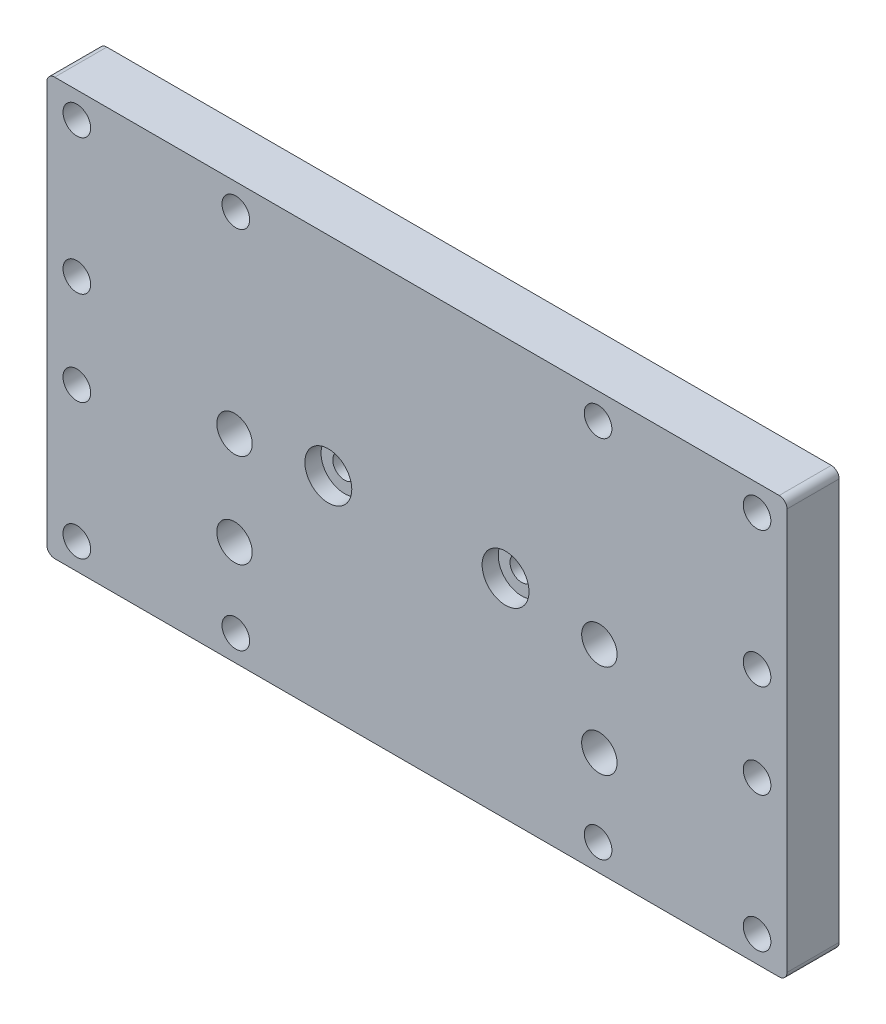
ISO-10303-21;
HEADER;
FILE_DESCRIPTION(('STEP AP214'),'2;1');
FILE_NAME('part.step','',(''),(''),'','','');
FILE_SCHEMA(('AUTOMOTIVE_DESIGN { 1 0 10303 214 1 1 1 1 }'));
ENDSEC;
DATA;
#1=APPLICATION_CONTEXT('core data for automotive mechanical design processes');
#2=APPLICATION_PROTOCOL_DEFINITION('international standard','automotive_design',2000,#1);
#3=PRODUCT_CONTEXT('',#1,'mechanical');
#4=PRODUCT('Part','Part','',(#3));
#5=PRODUCT_RELATED_PRODUCT_CATEGORY('part','',(#4));
#6=PRODUCT_DEFINITION_FORMATION('','',#4);
#7=PRODUCT_DEFINITION_CONTEXT('part definition',#1,'design');
#8=PRODUCT_DEFINITION('design','',#6,#7);
#9=PRODUCT_DEFINITION_SHAPE('','',#8);
#10=(LENGTH_UNIT() NAMED_UNIT(*) SI_UNIT(.MILLI.,.METRE.));
#11=(NAMED_UNIT(*) PLANE_ANGLE_UNIT() SI_UNIT($,.RADIAN.));
#12=(NAMED_UNIT(*) SI_UNIT($,.STERADIAN.) SOLID_ANGLE_UNIT());
#13=UNCERTAINTY_MEASURE_WITH_UNIT(LENGTH_MEASURE(1.E-05),#10,'distance_accuracy_value','');
#14=(GEOMETRIC_REPRESENTATION_CONTEXT(3) GLOBAL_UNCERTAINTY_ASSIGNED_CONTEXT((#13)) GLOBAL_UNIT_ASSIGNED_CONTEXT((#10,
#11,#12)) REPRESENTATION_CONTEXT('',''));
#15=CARTESIAN_POINT('',(0.,0.,0.));
#16=DIRECTION('',(0.,0.,1.));
#17=DIRECTION('',(1.,0.,0.));
#18=AXIS2_PLACEMENT_3D('',#15,#16,#17);
#19=CARTESIAN_POINT('',(71.,-40.,5.));
#20=DIRECTION('',(-1.,0.,0.));
#21=DIRECTION('',(0.,0.,1.));
#22=AXIS2_PLACEMENT_3D('',#19,#20,#21);
#23=PLANE('',#22);
#24=DIRECTION('',(0.,1.,0.));
#25=VECTOR('',#24,1.);
#26=CARTESIAN_POINT('',(71.,-40.,5.));
#27=LINE('',#26,#25);
#28=CARTESIAN_POINT('',(71.,-38.5,5.));
#29=VERTEX_POINT('',#28);
#30=CARTESIAN_POINT('',(71.,38.5,5.));
#31=VERTEX_POINT('',#30);
#32=EDGE_CURVE('E126',#29,#31,#27,.T.);
#33=ORIENTED_EDGE('',*,*,#32,.F.);
#34=DIRECTION('',(0.,0.,-1.));
#35=VECTOR('',#34,1.);
#36=CARTESIAN_POINT('',(71.,-38.5,5.));
#37=LINE('',#36,#35);
#38=CARTESIAN_POINT('',(71.,-38.5,-5.));
#39=VERTEX_POINT('',#38);
#40=EDGE_CURVE('E152',#29,#39,#37,.T.);
#41=ORIENTED_EDGE('',*,*,#40,.T.);
#42=DIRECTION('',(0.,1.,0.));
#43=VECTOR('',#42,1.);
#44=CARTESIAN_POINT('',(71.,-40.,-5.));
#45=LINE('',#44,#43);
#46=CARTESIAN_POINT('',(71.,38.5,-5.));
#47=VERTEX_POINT('',#46);
#48=EDGE_CURVE('E158',#39,#47,#45,.T.);
#49=ORIENTED_EDGE('',*,*,#48,.T.);
#50=DIRECTION('',(0.,0.,-1.));
#51=VECTOR('',#50,1.);
#52=CARTESIAN_POINT('',(71.,38.5,5.));
#53=LINE('',#52,#51);
#54=EDGE_CURVE('E150',#47,#31,#53,.F.);
#55=ORIENTED_EDGE('',*,*,#54,.T.);
#56=EDGE_LOOP('',(#33,#41,#49,#55));
#57=FACE_BOUND('',#56,.T.);
#58=ADVANCED_FACE('F34',(#57),#23,.F.);
#59=CARTESIAN_POINT('',(-71.,40.,5.));
#60=DIRECTION('',(0.,-1.,0.));
#61=DIRECTION('',(0.,0.,-1.));
#62=AXIS2_PLACEMENT_3D('',#59,#60,#61);
#63=PLANE('',#62);
#64=DIRECTION('',(-1.,0.,0.));
#65=VECTOR('',#64,1.);
#66=CARTESIAN_POINT('',(-71.,40.,5.));
#67=LINE('',#66,#65);
#68=CARTESIAN_POINT('',(69.5,40.,5.));
#69=VERTEX_POINT('',#68);
#70=CARTESIAN_POINT('',(-69.5,40.,5.));
#71=VERTEX_POINT('',#70);
#72=EDGE_CURVE('E129',#69,#71,#67,.T.);
#73=ORIENTED_EDGE('',*,*,#72,.F.);
#74=DIRECTION('',(0.,0.,-1.));
#75=VECTOR('',#74,1.);
#76=CARTESIAN_POINT('',(69.5,40.,5.));
#77=LINE('',#76,#75);
#78=CARTESIAN_POINT('',(69.5,40.,-5.));
#79=VERTEX_POINT('',#78);
#80=EDGE_CURVE('E11',#69,#79,#77,.T.);
#81=ORIENTED_EDGE('',*,*,#80,.T.);
#82=DIRECTION('',(-1.,0.,0.));
#83=VECTOR('',#82,1.);
#84=CARTESIAN_POINT('',(-71.,40.,-5.));
#85=LINE('',#84,#83);
#86=CARTESIAN_POINT('',(-69.5,40.,-5.));
#87=VERTEX_POINT('',#86);
#88=EDGE_CURVE('E131',#79,#87,#85,.T.);
#89=ORIENTED_EDGE('',*,*,#88,.T.);
#90=DIRECTION('',(0.,0.,-1.));
#91=VECTOR('',#90,1.);
#92=CARTESIAN_POINT('',(-69.5,40.,5.));
#93=LINE('',#92,#91);
#94=EDGE_CURVE('E42',#87,#71,#93,.F.);
#95=ORIENTED_EDGE('',*,*,#94,.T.);
#96=EDGE_LOOP('',(#73,#81,#89,#95));
#97=FACE_BOUND('',#96,.T.);
#98=ADVANCED_FACE('F336',(#97),#63,.F.);
#99=CARTESIAN_POINT('',(-71.,-40.,5.));
#100=DIRECTION('',(1.,0.,0.));
#101=DIRECTION('',(0.,0.,-1.));
#102=AXIS2_PLACEMENT_3D('',#99,#100,#101);
#103=PLANE('',#102);
#104=DIRECTION('',(0.,-1.,0.));
#105=VECTOR('',#104,1.);
#106=CARTESIAN_POINT('',(-71.,-40.,-5.));
#107=LINE('',#106,#105);
#108=CARTESIAN_POINT('',(-71.,38.5,-5.));
#109=VERTEX_POINT('',#108);
#110=CARTESIAN_POINT('',(-71.,-38.5,-5.));
#111=VERTEX_POINT('',#110);
#112=EDGE_CURVE('E127',#109,#111,#107,.T.);
#113=ORIENTED_EDGE('',*,*,#112,.T.);
#114=DIRECTION('',(0.,0.,-1.));
#115=VECTOR('',#114,1.);
#116=CARTESIAN_POINT('',(-71.,-38.5,5.));
#117=LINE('',#116,#115);
#118=CARTESIAN_POINT('',(-71.,-38.5,5.));
#119=VERTEX_POINT('',#118);
#120=EDGE_CURVE('E105',#111,#119,#117,.F.);
#121=ORIENTED_EDGE('',*,*,#120,.T.);
#122=DIRECTION('',(0.,-1.,0.));
#123=VECTOR('',#122,1.);
#124=CARTESIAN_POINT('',(-71.,-40.,5.));
#125=LINE('',#124,#123);
#126=CARTESIAN_POINT('',(-71.,38.5,5.));
#127=VERTEX_POINT('',#126);
#128=EDGE_CURVE('E170',#127,#119,#125,.T.);
#129=ORIENTED_EDGE('',*,*,#128,.F.);
#130=DIRECTION('',(0.,0.,-1.));
#131=VECTOR('',#130,1.);
#132=CARTESIAN_POINT('',(-71.,38.5,5.));
#133=LINE('',#132,#131);
#134=EDGE_CURVE('E110',#127,#109,#133,.T.);
#135=ORIENTED_EDGE('',*,*,#134,.T.);
#136=EDGE_LOOP('',(#113,#121,#129,#135));
#137=FACE_BOUND('',#136,.T.);
#138=ADVANCED_FACE('F334',(#137),#103,.F.);
#139=CARTESIAN_POINT('',(-71.,-40.,5.));
#140=DIRECTION('',(0.,1.,0.));
#141=DIRECTION('',(0.,0.,1.));
#142=AXIS2_PLACEMENT_3D('',#139,#140,#141);
#143=PLANE('',#142);
#144=DIRECTION('',(1.,0.,0.));
#145=VECTOR('',#144,1.);
#146=CARTESIAN_POINT('',(-71.,-40.,5.));
#147=LINE('',#146,#145);
#148=CARTESIAN_POINT('',(-69.5,-40.,5.));
#149=VERTEX_POINT('',#148);
#150=CARTESIAN_POINT('',(69.5,-40.,5.));
#151=VERTEX_POINT('',#150);
#152=EDGE_CURVE('E120',#149,#151,#147,.T.);
#153=ORIENTED_EDGE('',*,*,#152,.F.);
#154=DIRECTION('',(0.,0.,-1.));
#155=VECTOR('',#154,1.);
#156=CARTESIAN_POINT('',(-69.5,-40.,5.));
#157=LINE('',#156,#155);
#158=CARTESIAN_POINT('',(-69.5,-40.,-5.));
#159=VERTEX_POINT('',#158);
#160=EDGE_CURVE('E104',#149,#159,#157,.T.);
#161=ORIENTED_EDGE('',*,*,#160,.T.);
#162=DIRECTION('',(1.,0.,0.));
#163=VECTOR('',#162,1.);
#164=CARTESIAN_POINT('',(-71.,-40.,-5.));
#165=LINE('',#164,#163);
#166=CARTESIAN_POINT('',(69.5,-40.,-5.));
#167=VERTEX_POINT('',#166);
#168=EDGE_CURVE('E117',#159,#167,#165,.T.);
#169=ORIENTED_EDGE('',*,*,#168,.T.);
#170=DIRECTION('',(0.,0.,-1.));
#171=VECTOR('',#170,1.);
#172=CARTESIAN_POINT('',(69.5,-40.,5.));
#173=LINE('',#172,#171);
#174=EDGE_CURVE('E122',#167,#151,#173,.F.);
#175=ORIENTED_EDGE('',*,*,#174,.T.);
#176=EDGE_LOOP('',(#153,#161,#169,#175));
#177=FACE_BOUND('',#176,.T.);
#178=ADVANCED_FACE('F116',(#177),#143,.F.);
#179=CARTESIAN_POINT('',(0.,0.,5.));
#180=DIRECTION('',(0.,0.,-1.));
#181=DIRECTION('',(-1.,0.,0.));
#182=AXIS2_PLACEMENT_3D('',#179,#180,#181);
#183=PLANE('',#182);
#184=CARTESIAN_POINT('',(-35.,-2.00000000000001,5.));
#185=DIRECTION('',(0.,0.,1.));
#186=DIRECTION('',(1.,0.,0.));
#187=AXIS2_PLACEMENT_3D('',#184,#185,#186);
#188=CIRCLE('',#187,3.39999999999999);
#189=CARTESIAN_POINT('',(-31.6,-2.00000000000001,5.));
#190=VERTEX_POINT('',#189);
#191=EDGE_CURVE('E287',#190,#190,#188,.T.);
#192=ORIENTED_EDGE('',*,*,#191,.F.);
#193=EDGE_LOOP('',(#192));
#194=FACE_BOUND('',#193,.T.);
#195=CARTESIAN_POINT('',(35.,-2.00000000000001,5.));
#196=DIRECTION('',(0.,0.,1.));
#197=DIRECTION('',(1.,0.,0.));
#198=AXIS2_PLACEMENT_3D('',#195,#196,#197);
#199=CIRCLE('',#198,3.39999999999999);
#200=CARTESIAN_POINT('',(38.4,-2.00000000000001,5.));
#201=VERTEX_POINT('',#200);
#202=EDGE_CURVE('E281',#201,#201,#199,.T.);
#203=ORIENTED_EDGE('',*,*,#202,.F.);
#204=EDGE_LOOP('',(#203));
#205=FACE_BOUND('',#204,.T.);
#206=CARTESIAN_POINT('',(35.,-20.,5.));
#207=DIRECTION('',(0.,0.,1.));
#208=DIRECTION('',(1.,0.,0.));
#209=AXIS2_PLACEMENT_3D('',#206,#207,#208);
#210=CIRCLE('',#209,3.39999999999999);
#211=CARTESIAN_POINT('',(38.4,-20.,5.));
#212=VERTEX_POINT('',#211);
#213=EDGE_CURVE('E275',#212,#212,#210,.T.);
#214=ORIENTED_EDGE('',*,*,#213,.F.);
#215=EDGE_LOOP('',(#214));
#216=FACE_BOUND('',#215,.T.);
#217=CARTESIAN_POINT('',(-35.,-20.,5.));
#218=DIRECTION('',(0.,0.,1.));
#219=DIRECTION('',(1.,0.,0.));
#220=AXIS2_PLACEMENT_3D('',#217,#218,#219);
#221=CIRCLE('',#220,3.39999999999999);
#222=CARTESIAN_POINT('',(-31.6,-20.,5.));
#223=VERTEX_POINT('',#222);
#224=EDGE_CURVE('E269',#223,#223,#221,.T.);
#225=ORIENTED_EDGE('',*,*,#224,.F.);
#226=EDGE_LOOP('',(#225));
#227=FACE_BOUND('',#226,.T.);
#228=CARTESIAN_POINT('',(-17.,0.,5.));
#229=DIRECTION('',(0.,0.,1.));
#230=DIRECTION('',(1.,0.,0.));
#231=AXIS2_PLACEMENT_3D('',#228,#229,#230);
#232=CIRCLE('',#231,4.5);
#233=CARTESIAN_POINT('',(-12.5,0.,5.));
#234=VERTEX_POINT('',#233);
#235=EDGE_CURVE('E263',#234,#234,#232,.T.);
#236=ORIENTED_EDGE('',*,*,#235,.F.);
#237=EDGE_LOOP('',(#236));
#238=FACE_BOUND('',#237,.T.);
#239=CARTESIAN_POINT('',(17.,0.,5.));
#240=DIRECTION('',(0.,0.,1.));
#241=DIRECTION('',(1.,0.,0.));
#242=AXIS2_PLACEMENT_3D('',#239,#240,#241);
#243=CIRCLE('',#242,4.5);
#244=CARTESIAN_POINT('',(21.5,0.,5.));
#245=VERTEX_POINT('',#244);
#246=EDGE_CURVE('E251',#245,#245,#243,.T.);
#247=ORIENTED_EDGE('',*,*,#246,.F.);
#248=EDGE_LOOP('',(#247));
#249=FACE_BOUND('',#248,.T.);
#250=CARTESIAN_POINT('',(-65.25,-35.,5.));
#251=DIRECTION('',(0.,0.,1.));
#252=DIRECTION('',(1.,0.,0.));
#253=AXIS2_PLACEMENT_3D('',#250,#251,#252);
#254=CIRCLE('',#253,2.64999999999999);
#255=CARTESIAN_POINT('',(-62.6,-35.,5.));
#256=VERTEX_POINT('',#255);
#257=EDGE_CURVE('E239',#256,#256,#254,.T.);
#258=ORIENTED_EDGE('',*,*,#257,.F.);
#259=EDGE_LOOP('',(#258));
#260=FACE_BOUND('',#259,.T.);
#261=CARTESIAN_POINT('',(-34.75,-35.,5.));
#262=DIRECTION('',(0.,0.,1.));
#263=DIRECTION('',(1.,0.,0.));
#264=AXIS2_PLACEMENT_3D('',#261,#262,#263);
#265=CIRCLE('',#264,2.64999999999999);
#266=CARTESIAN_POINT('',(-32.1,-35.,5.));
#267=VERTEX_POINT('',#266);
#268=EDGE_CURVE('E233',#267,#267,#265,.T.);
#269=ORIENTED_EDGE('',*,*,#268,.F.);
#270=EDGE_LOOP('',(#269));
#271=FACE_BOUND('',#270,.T.);
#272=CARTESIAN_POINT('',(-65.25,-9.,5.));
#273=DIRECTION('',(0.,0.,1.));
#274=DIRECTION('',(1.,0.,0.));
#275=AXIS2_PLACEMENT_3D('',#272,#273,#274);
#276=CIRCLE('',#275,2.64999999999999);
#277=CARTESIAN_POINT('',(-62.6,-9.,5.));
#278=VERTEX_POINT('',#277);
#279=EDGE_CURVE('E227',#278,#278,#276,.T.);
#280=ORIENTED_EDGE('',*,*,#279,.F.);
#281=EDGE_LOOP('',(#280));
#282=FACE_BOUND('',#281,.T.);
#283=CARTESIAN_POINT('',(65.25,-35.,5.));
#284=DIRECTION('',(0.,0.,1.));
#285=DIRECTION('',(1.,0.,0.));
#286=AXIS2_PLACEMENT_3D('',#283,#284,#285);
#287=CIRCLE('',#286,2.64999999999999);
#288=CARTESIAN_POINT('',(67.9,-35.,5.));
#289=VERTEX_POINT('',#288);
#290=EDGE_CURVE('E221',#289,#289,#287,.T.);
#291=ORIENTED_EDGE('',*,*,#290,.F.);
#292=EDGE_LOOP('',(#291));
#293=FACE_BOUND('',#292,.T.);
#294=CARTESIAN_POINT('',(34.75,-35.,5.));
#295=DIRECTION('',(0.,0.,1.));
#296=DIRECTION('',(1.,0.,0.));
#297=AXIS2_PLACEMENT_3D('',#294,#295,#296);
#298=CIRCLE('',#297,2.64999999999999);
#299=CARTESIAN_POINT('',(37.4,-35.,5.));
#300=VERTEX_POINT('',#299);
#301=EDGE_CURVE('E215',#300,#300,#298,.T.);
#302=ORIENTED_EDGE('',*,*,#301,.F.);
#303=EDGE_LOOP('',(#302));
#304=FACE_BOUND('',#303,.T.);
#305=CARTESIAN_POINT('',(65.25,-9.,5.));
#306=DIRECTION('',(0.,0.,1.));
#307=DIRECTION('',(1.,0.,0.));
#308=AXIS2_PLACEMENT_3D('',#305,#306,#307);
#309=CIRCLE('',#308,2.64999999999999);
#310=CARTESIAN_POINT('',(67.9,-9.,5.));
#311=VERTEX_POINT('',#310);
#312=EDGE_CURVE('E209',#311,#311,#309,.T.);
#313=ORIENTED_EDGE('',*,*,#312,.F.);
#314=EDGE_LOOP('',(#313));
#315=FACE_BOUND('',#314,.T.);
#316=CARTESIAN_POINT('',(65.25,35.,5.));
#317=DIRECTION('',(0.,0.,1.));
#318=DIRECTION('',(1.,0.,0.));
#319=AXIS2_PLACEMENT_3D('',#316,#317,#318);
#320=CIRCLE('',#319,2.64999999999999);
#321=CARTESIAN_POINT('',(67.9,35.,5.));
#322=VERTEX_POINT('',#321);
#323=EDGE_CURVE('E203',#322,#322,#320,.T.);
#324=ORIENTED_EDGE('',*,*,#323,.F.);
#325=EDGE_LOOP('',(#324));
#326=FACE_BOUND('',#325,.T.);
#327=CARTESIAN_POINT('',(34.75,35.,5.));
#328=DIRECTION('',(0.,0.,1.));
#329=DIRECTION('',(1.,0.,0.));
#330=AXIS2_PLACEMENT_3D('',#327,#328,#329);
#331=CIRCLE('',#330,2.64999999999999);
#332=CARTESIAN_POINT('',(37.4,35.,5.));
#333=VERTEX_POINT('',#332);
#334=EDGE_CURVE('E197',#333,#333,#331,.T.);
#335=ORIENTED_EDGE('',*,*,#334,.F.);
#336=EDGE_LOOP('',(#335));
#337=FACE_BOUND('',#336,.T.);
#338=CARTESIAN_POINT('',(65.25,9.,5.));
#339=DIRECTION('',(0.,0.,1.));
#340=DIRECTION('',(1.,0.,0.));
#341=AXIS2_PLACEMENT_3D('',#338,#339,#340);
#342=CIRCLE('',#341,2.64999999999999);
#343=CARTESIAN_POINT('',(67.9,9.,5.));
#344=VERTEX_POINT('',#343);
#345=EDGE_CURVE('E191',#344,#344,#342,.T.);
#346=ORIENTED_EDGE('',*,*,#345,.F.);
#347=EDGE_LOOP('',(#346));
#348=FACE_BOUND('',#347,.T.);
#349=CARTESIAN_POINT('',(-65.25,35.,5.));
#350=DIRECTION('',(0.,0.,1.));
#351=DIRECTION('',(1.,0.,0.));
#352=AXIS2_PLACEMENT_3D('',#349,#350,#351);
#353=CIRCLE('',#352,2.64999999999999);
#354=CARTESIAN_POINT('',(-62.6,35.,5.));
#355=VERTEX_POINT('',#354);
#356=EDGE_CURVE('E185',#355,#355,#353,.T.);
#357=ORIENTED_EDGE('',*,*,#356,.F.);
#358=EDGE_LOOP('',(#357));
#359=FACE_BOUND('',#358,.T.);
#360=CARTESIAN_POINT('',(-34.75,35.,5.));
#361=DIRECTION('',(0.,0.,1.));
#362=DIRECTION('',(1.,0.,0.));
#363=AXIS2_PLACEMENT_3D('',#360,#361,#362);
#364=CIRCLE('',#363,2.64999999999999);
#365=CARTESIAN_POINT('',(-32.1,35.,5.));
#366=VERTEX_POINT('',#365);
#367=EDGE_CURVE('E179',#366,#366,#364,.T.);
#368=ORIENTED_EDGE('',*,*,#367,.F.);
#369=EDGE_LOOP('',(#368));
#370=FACE_BOUND('',#369,.T.);
#371=CARTESIAN_POINT('',(-65.25,9.,5.));
#372=DIRECTION('',(0.,0.,1.));
#373=DIRECTION('',(1.,0.,0.));
#374=AXIS2_PLACEMENT_3D('',#371,#372,#373);
#375=CIRCLE('',#374,2.64999999999999);
#376=CARTESIAN_POINT('',(-62.6,9.,5.));
#377=VERTEX_POINT('',#376);
#378=EDGE_CURVE('E166',#377,#377,#375,.T.);
#379=ORIENTED_EDGE('',*,*,#378,.F.);
#380=EDGE_LOOP('',(#379));
#381=FACE_BOUND('',#380,.T.);
#382=ORIENTED_EDGE('',*,*,#128,.T.);
#383=CARTESIAN_POINT('',(-69.5,-38.5,5.));
#384=DIRECTION('',(0.,0.,-1.));
#385=DIRECTION('',(-1.,0.,0.));
#386=AXIS2_PLACEMENT_3D('',#383,#384,#385);
#387=CIRCLE('',#386,1.5);
#388=EDGE_CURVE('E148',#119,#149,#387,.F.);
#389=ORIENTED_EDGE('',*,*,#388,.T.);
#390=ORIENTED_EDGE('',*,*,#152,.T.);
#391=CARTESIAN_POINT('',(69.5,-38.5,5.));
#392=DIRECTION('',(0.,0.,-1.));
#393=DIRECTION('',(-1.,0.,0.));
#394=AXIS2_PLACEMENT_3D('',#391,#392,#393);
#395=CIRCLE('',#394,1.5);
#396=EDGE_CURVE('E146',#151,#29,#395,.F.);
#397=ORIENTED_EDGE('',*,*,#396,.T.);
#398=ORIENTED_EDGE('',*,*,#32,.T.);
#399=CARTESIAN_POINT('',(69.5,38.5,5.));
#400=DIRECTION('',(0.,0.,-1.));
#401=DIRECTION('',(-1.,0.,0.));
#402=AXIS2_PLACEMENT_3D('',#399,#400,#401);
#403=CIRCLE('',#402,1.5);
#404=EDGE_CURVE('E55',#31,#69,#403,.F.);
#405=ORIENTED_EDGE('',*,*,#404,.T.);
#406=ORIENTED_EDGE('',*,*,#72,.T.);
#407=CARTESIAN_POINT('',(-69.5,38.5,5.));
#408=DIRECTION('',(0.,0.,-1.));
#409=DIRECTION('',(-1.,0.,0.));
#410=AXIS2_PLACEMENT_3D('',#407,#408,#409);
#411=CIRCLE('',#410,1.5);
#412=EDGE_CURVE('E143',#71,#127,#411,.F.);
#413=ORIENTED_EDGE('',*,*,#412,.T.);
#414=EDGE_LOOP('',(#382,#389,#390,#397,#398,#405,#406,#413));
#415=FACE_BOUND('',#414,.T.);
#416=ADVANCED_FACE('F293',(#194,#205,#216,#227,#238,#249,#260,#271,#282,#293,#304,#315,#326,
#337,#348,#359,#370,#381,#415),#183,.F.);
#417=CARTESIAN_POINT('',(0.,0.,-5.));
#418=DIRECTION('',(0.,0.,-1.));
#419=DIRECTION('',(-1.,0.,0.));
#420=AXIS2_PLACEMENT_3D('',#417,#418,#419);
#421=PLANE('',#420);
#422=CARTESIAN_POINT('',(-35.,-2.00000000000001,-5.));
#423=DIRECTION('',(0.,0.,1.));
#424=DIRECTION('',(1.,0.,0.));
#425=AXIS2_PLACEMENT_3D('',#422,#423,#424);
#426=CIRCLE('',#425,3.39999999999999);
#427=CARTESIAN_POINT('',(-31.6,-2.00000000000001,-5.));
#428=VERTEX_POINT('',#427);
#429=EDGE_CURVE('E284',#428,#428,#426,.T.);
#430=ORIENTED_EDGE('',*,*,#429,.T.);
#431=EDGE_LOOP('',(#430));
#432=FACE_BOUND('',#431,.T.);
#433=CARTESIAN_POINT('',(35.,-2.00000000000001,-5.));
#434=DIRECTION('',(0.,0.,1.));
#435=DIRECTION('',(1.,0.,0.));
#436=AXIS2_PLACEMENT_3D('',#433,#434,#435);
#437=CIRCLE('',#436,3.39999999999999);
#438=CARTESIAN_POINT('',(38.4,-2.00000000000001,-5.));
#439=VERTEX_POINT('',#438);
#440=EDGE_CURVE('E278',#439,#439,#437,.T.);
#441=ORIENTED_EDGE('',*,*,#440,.T.);
#442=EDGE_LOOP('',(#441));
#443=FACE_BOUND('',#442,.T.);
#444=CARTESIAN_POINT('',(35.,-20.,-5.));
#445=DIRECTION('',(0.,0.,1.));
#446=DIRECTION('',(1.,0.,0.));
#447=AXIS2_PLACEMENT_3D('',#444,#445,#446);
#448=CIRCLE('',#447,3.39999999999999);
#449=CARTESIAN_POINT('',(38.4,-20.,-5.));
#450=VERTEX_POINT('',#449);
#451=EDGE_CURVE('E272',#450,#450,#448,.T.);
#452=ORIENTED_EDGE('',*,*,#451,.T.);
#453=EDGE_LOOP('',(#452));
#454=FACE_BOUND('',#453,.T.);
#455=CARTESIAN_POINT('',(-35.,-20.,-5.));
#456=DIRECTION('',(0.,0.,1.));
#457=DIRECTION('',(1.,0.,0.));
#458=AXIS2_PLACEMENT_3D('',#455,#456,#457);
#459=CIRCLE('',#458,3.39999999999999);
#460=CARTESIAN_POINT('',(-31.6,-20.,-5.));
#461=VERTEX_POINT('',#460);
#462=EDGE_CURVE('E266',#461,#461,#459,.T.);
#463=ORIENTED_EDGE('',*,*,#462,.T.);
#464=EDGE_LOOP('',(#463));
#465=FACE_BOUND('',#464,.T.);
#466=CARTESIAN_POINT('',(-17.,0.,-5.));
#467=DIRECTION('',(0.,0.,1.));
#468=DIRECTION('',(1.,0.,0.));
#469=AXIS2_PLACEMENT_3D('',#466,#467,#468);
#470=CIRCLE('',#469,2.25);
#471=CARTESIAN_POINT('',(-14.75,0.,-5.));
#472=VERTEX_POINT('',#471);
#473=EDGE_CURVE('E254',#472,#472,#470,.T.);
#474=ORIENTED_EDGE('',*,*,#473,.T.);
#475=EDGE_LOOP('',(#474));
#476=FACE_BOUND('',#475,.T.);
#477=CARTESIAN_POINT('',(17.,0.,-5.));
#478=DIRECTION('',(0.,0.,1.));
#479=DIRECTION('',(1.,0.,0.));
#480=AXIS2_PLACEMENT_3D('',#477,#478,#479);
#481=CIRCLE('',#480,2.25);
#482=CARTESIAN_POINT('',(19.25,0.,-5.));
#483=VERTEX_POINT('',#482);
#484=EDGE_CURVE('E242',#483,#483,#481,.T.);
#485=ORIENTED_EDGE('',*,*,#484,.T.);
#486=EDGE_LOOP('',(#485));
#487=FACE_BOUND('',#486,.T.);
#488=CARTESIAN_POINT('',(-65.25,-35.,-5.));
#489=DIRECTION('',(0.,0.,1.));
#490=DIRECTION('',(1.,0.,0.));
#491=AXIS2_PLACEMENT_3D('',#488,#489,#490);
#492=CIRCLE('',#491,2.64999999999999);
#493=CARTESIAN_POINT('',(-62.6,-35.,-5.));
#494=VERTEX_POINT('',#493);
#495=EDGE_CURVE('E236',#494,#494,#492,.T.);
#496=ORIENTED_EDGE('',*,*,#495,.T.);
#497=EDGE_LOOP('',(#496));
#498=FACE_BOUND('',#497,.T.);
#499=CARTESIAN_POINT('',(-34.75,-35.,-5.));
#500=DIRECTION('',(0.,0.,1.));
#501=DIRECTION('',(1.,0.,0.));
#502=AXIS2_PLACEMENT_3D('',#499,#500,#501);
#503=CIRCLE('',#502,2.64999999999999);
#504=CARTESIAN_POINT('',(-32.1,-35.,-5.));
#505=VERTEX_POINT('',#504);
#506=EDGE_CURVE('E230',#505,#505,#503,.T.);
#507=ORIENTED_EDGE('',*,*,#506,.T.);
#508=EDGE_LOOP('',(#507));
#509=FACE_BOUND('',#508,.T.);
#510=CARTESIAN_POINT('',(-65.25,-9.,-5.));
#511=DIRECTION('',(0.,0.,1.));
#512=DIRECTION('',(1.,0.,0.));
#513=AXIS2_PLACEMENT_3D('',#510,#511,#512);
#514=CIRCLE('',#513,2.64999999999999);
#515=CARTESIAN_POINT('',(-62.6,-9.,-5.));
#516=VERTEX_POINT('',#515);
#517=EDGE_CURVE('E224',#516,#516,#514,.T.);
#518=ORIENTED_EDGE('',*,*,#517,.T.);
#519=EDGE_LOOP('',(#518));
#520=FACE_BOUND('',#519,.T.);
#521=CARTESIAN_POINT('',(65.25,-35.,-5.));
#522=DIRECTION('',(0.,0.,1.));
#523=DIRECTION('',(1.,0.,0.));
#524=AXIS2_PLACEMENT_3D('',#521,#522,#523);
#525=CIRCLE('',#524,2.64999999999999);
#526=CARTESIAN_POINT('',(67.9,-35.,-5.));
#527=VERTEX_POINT('',#526);
#528=EDGE_CURVE('E218',#527,#527,#525,.T.);
#529=ORIENTED_EDGE('',*,*,#528,.T.);
#530=EDGE_LOOP('',(#529));
#531=FACE_BOUND('',#530,.T.);
#532=CARTESIAN_POINT('',(34.75,-35.,-5.));
#533=DIRECTION('',(0.,0.,1.));
#534=DIRECTION('',(1.,0.,0.));
#535=AXIS2_PLACEMENT_3D('',#532,#533,#534);
#536=CIRCLE('',#535,2.64999999999999);
#537=CARTESIAN_POINT('',(37.4,-35.,-5.));
#538=VERTEX_POINT('',#537);
#539=EDGE_CURVE('E212',#538,#538,#536,.T.);
#540=ORIENTED_EDGE('',*,*,#539,.T.);
#541=EDGE_LOOP('',(#540));
#542=FACE_BOUND('',#541,.T.);
#543=CARTESIAN_POINT('',(65.25,-9.,-5.));
#544=DIRECTION('',(0.,0.,1.));
#545=DIRECTION('',(1.,0.,0.));
#546=AXIS2_PLACEMENT_3D('',#543,#544,#545);
#547=CIRCLE('',#546,2.64999999999999);
#548=CARTESIAN_POINT('',(67.9,-9.,-5.));
#549=VERTEX_POINT('',#548);
#550=EDGE_CURVE('E206',#549,#549,#547,.T.);
#551=ORIENTED_EDGE('',*,*,#550,.T.);
#552=EDGE_LOOP('',(#551));
#553=FACE_BOUND('',#552,.T.);
#554=CARTESIAN_POINT('',(65.25,35.,-5.));
#555=DIRECTION('',(0.,0.,1.));
#556=DIRECTION('',(1.,0.,0.));
#557=AXIS2_PLACEMENT_3D('',#554,#555,#556);
#558=CIRCLE('',#557,2.64999999999999);
#559=CARTESIAN_POINT('',(67.9,35.,-5.));
#560=VERTEX_POINT('',#559);
#561=EDGE_CURVE('E200',#560,#560,#558,.T.);
#562=ORIENTED_EDGE('',*,*,#561,.T.);
#563=EDGE_LOOP('',(#562));
#564=FACE_BOUND('',#563,.T.);
#565=CARTESIAN_POINT('',(34.75,35.,-5.));
#566=DIRECTION('',(0.,0.,1.));
#567=DIRECTION('',(1.,0.,0.));
#568=AXIS2_PLACEMENT_3D('',#565,#566,#567);
#569=CIRCLE('',#568,2.64999999999999);
#570=CARTESIAN_POINT('',(37.4,35.,-5.));
#571=VERTEX_POINT('',#570);
#572=EDGE_CURVE('E194',#571,#571,#569,.T.);
#573=ORIENTED_EDGE('',*,*,#572,.T.);
#574=EDGE_LOOP('',(#573));
#575=FACE_BOUND('',#574,.T.);
#576=CARTESIAN_POINT('',(65.25,9.,-5.));
#577=DIRECTION('',(0.,0.,1.));
#578=DIRECTION('',(1.,0.,0.));
#579=AXIS2_PLACEMENT_3D('',#576,#577,#578);
#580=CIRCLE('',#579,2.64999999999999);
#581=CARTESIAN_POINT('',(67.9,9.,-5.));
#582=VERTEX_POINT('',#581);
#583=EDGE_CURVE('E188',#582,#582,#580,.T.);
#584=ORIENTED_EDGE('',*,*,#583,.T.);
#585=EDGE_LOOP('',(#584));
#586=FACE_BOUND('',#585,.T.);
#587=CARTESIAN_POINT('',(-65.25,35.,-5.));
#588=DIRECTION('',(0.,0.,1.));
#589=DIRECTION('',(1.,0.,0.));
#590=AXIS2_PLACEMENT_3D('',#587,#588,#589);
#591=CIRCLE('',#590,2.64999999999999);
#592=CARTESIAN_POINT('',(-62.6,35.,-5.));
#593=VERTEX_POINT('',#592);
#594=EDGE_CURVE('E182',#593,#593,#591,.T.);
#595=ORIENTED_EDGE('',*,*,#594,.T.);
#596=EDGE_LOOP('',(#595));
#597=FACE_BOUND('',#596,.T.);
#598=CARTESIAN_POINT('',(-34.75,35.,-5.));
#599=DIRECTION('',(0.,0.,1.));
#600=DIRECTION('',(1.,0.,0.));
#601=AXIS2_PLACEMENT_3D('',#598,#599,#600);
#602=CIRCLE('',#601,2.64999999999999);
#603=CARTESIAN_POINT('',(-32.1,35.,-5.));
#604=VERTEX_POINT('',#603);
#605=EDGE_CURVE('E176',#604,#604,#602,.T.);
#606=ORIENTED_EDGE('',*,*,#605,.T.);
#607=EDGE_LOOP('',(#606));
#608=FACE_BOUND('',#607,.T.);
#609=CARTESIAN_POINT('',(-65.25,9.,-5.));
#610=DIRECTION('',(0.,0.,1.));
#611=DIRECTION('',(1.,0.,0.));
#612=AXIS2_PLACEMENT_3D('',#609,#610,#611);
#613=CIRCLE('',#612,2.64999999999999);
#614=CARTESIAN_POINT('',(-62.6,9.,-5.));
#615=VERTEX_POINT('',#614);
#616=EDGE_CURVE('E163',#615,#615,#613,.T.);
#617=ORIENTED_EDGE('',*,*,#616,.T.);
#618=EDGE_LOOP('',(#617));
#619=FACE_BOUND('',#618,.T.);
#620=ORIENTED_EDGE('',*,*,#168,.F.);
#621=CARTESIAN_POINT('',(-69.5,-38.5,-5.));
#622=DIRECTION('',(0.,0.,-1.));
#623=DIRECTION('',(-1.,0.,0.));
#624=AXIS2_PLACEMENT_3D('',#621,#622,#623);
#625=CIRCLE('',#624,1.5);
#626=EDGE_CURVE('E100',#159,#111,#625,.T.);
#627=ORIENTED_EDGE('',*,*,#626,.T.);
#628=ORIENTED_EDGE('',*,*,#112,.F.);
#629=CARTESIAN_POINT('',(-69.5,38.5,-5.));
#630=DIRECTION('',(0.,0.,-1.));
#631=DIRECTION('',(-1.,0.,0.));
#632=AXIS2_PLACEMENT_3D('',#629,#630,#631);
#633=CIRCLE('',#632,1.5);
#634=EDGE_CURVE('E121',#109,#87,#633,.T.);
#635=ORIENTED_EDGE('',*,*,#634,.T.);
#636=ORIENTED_EDGE('',*,*,#88,.F.);
#637=CARTESIAN_POINT('',(69.5,38.5,-5.));
#638=DIRECTION('',(0.,0.,-1.));
#639=DIRECTION('',(-1.,0.,0.));
#640=AXIS2_PLACEMENT_3D('',#637,#638,#639);
#641=CIRCLE('',#640,1.5);
#642=EDGE_CURVE('E137',#79,#47,#641,.T.);
#643=ORIENTED_EDGE('',*,*,#642,.T.);
#644=ORIENTED_EDGE('',*,*,#48,.F.);
#645=CARTESIAN_POINT('',(69.5,-38.5,-5.));
#646=DIRECTION('',(0.,0.,-1.));
#647=DIRECTION('',(-1.,0.,0.));
#648=AXIS2_PLACEMENT_3D('',#645,#646,#647);
#649=CIRCLE('',#648,1.5);
#650=EDGE_CURVE('E111',#39,#167,#649,.T.);
#651=ORIENTED_EDGE('',*,*,#650,.T.);
#652=EDGE_LOOP('',(#620,#627,#628,#635,#636,#643,#644,#651));
#653=FACE_BOUND('',#652,.T.);
#654=ADVANCED_FACE('F124',(#432,#443,#454,#465,#476,#487,#498,#509,#520,#531,#542,#553,#564,
#575,#586,#597,#608,#619,#653),#421,.T.);
#655=CARTESIAN_POINT('',(-65.25,9.,5.));
#656=DIRECTION('',(0.,0.,1.));
#657=DIRECTION('',(1.,0.,0.));
#658=AXIS2_PLACEMENT_3D('',#655,#656,#657);
#659=CYLINDRICAL_SURFACE('',#658,2.64999999999999);
#660=ORIENTED_EDGE('',*,*,#616,.F.);
#661=EDGE_LOOP('',(#660));
#662=FACE_BOUND('',#661,.T.);
#663=ORIENTED_EDGE('',*,*,#378,.T.);
#664=EDGE_LOOP('',(#663));
#665=FACE_BOUND('',#664,.T.);
#666=ADVANCED_FACE('F360',(#662,#665),#659,.F.);
#667=CARTESIAN_POINT('',(-34.75,35.,5.));
#668=DIRECTION('',(0.,0.,1.));
#669=DIRECTION('',(1.,0.,0.));
#670=AXIS2_PLACEMENT_3D('',#667,#668,#669);
#671=CYLINDRICAL_SURFACE('',#670,2.64999999999999);
#672=ORIENTED_EDGE('',*,*,#605,.F.);
#673=EDGE_LOOP('',(#672));
#674=FACE_BOUND('',#673,.T.);
#675=ORIENTED_EDGE('',*,*,#367,.T.);
#676=EDGE_LOOP('',(#675));
#677=FACE_BOUND('',#676,.T.);
#678=ADVANCED_FACE('F365',(#674,#677),#671,.F.);
#679=CARTESIAN_POINT('',(-65.25,35.,5.));
#680=DIRECTION('',(0.,0.,1.));
#681=DIRECTION('',(1.,0.,0.));
#682=AXIS2_PLACEMENT_3D('',#679,#680,#681);
#683=CYLINDRICAL_SURFACE('',#682,2.64999999999999);
#684=ORIENTED_EDGE('',*,*,#594,.F.);
#685=EDGE_LOOP('',(#684));
#686=FACE_BOUND('',#685,.T.);
#687=ORIENTED_EDGE('',*,*,#356,.T.);
#688=EDGE_LOOP('',(#687));
#689=FACE_BOUND('',#688,.T.);
#690=ADVANCED_FACE('F369',(#686,#689),#683,.F.);
#691=CARTESIAN_POINT('',(65.25,9.,5.));
#692=DIRECTION('',(0.,0.,1.));
#693=DIRECTION('',(1.,0.,0.));
#694=AXIS2_PLACEMENT_3D('',#691,#692,#693);
#695=CYLINDRICAL_SURFACE('',#694,2.64999999999999);
#696=ORIENTED_EDGE('',*,*,#583,.F.);
#697=EDGE_LOOP('',(#696));
#698=FACE_BOUND('',#697,.T.);
#699=ORIENTED_EDGE('',*,*,#345,.T.);
#700=EDGE_LOOP('',(#699));
#701=FACE_BOUND('',#700,.T.);
#702=ADVANCED_FACE('F373',(#698,#701),#695,.F.);
#703=CARTESIAN_POINT('',(34.75,35.,5.));
#704=DIRECTION('',(0.,0.,1.));
#705=DIRECTION('',(1.,0.,0.));
#706=AXIS2_PLACEMENT_3D('',#703,#704,#705);
#707=CYLINDRICAL_SURFACE('',#706,2.64999999999999);
#708=ORIENTED_EDGE('',*,*,#572,.F.);
#709=EDGE_LOOP('',(#708));
#710=FACE_BOUND('',#709,.T.);
#711=ORIENTED_EDGE('',*,*,#334,.T.);
#712=EDGE_LOOP('',(#711));
#713=FACE_BOUND('',#712,.T.);
#714=ADVANCED_FACE('F377',(#710,#713),#707,.F.);
#715=CARTESIAN_POINT('',(65.25,35.,5.));
#716=DIRECTION('',(0.,0.,1.));
#717=DIRECTION('',(1.,0.,0.));
#718=AXIS2_PLACEMENT_3D('',#715,#716,#717);
#719=CYLINDRICAL_SURFACE('',#718,2.64999999999999);
#720=ORIENTED_EDGE('',*,*,#561,.F.);
#721=EDGE_LOOP('',(#720));
#722=FACE_BOUND('',#721,.T.);
#723=ORIENTED_EDGE('',*,*,#323,.T.);
#724=EDGE_LOOP('',(#723));
#725=FACE_BOUND('',#724,.T.);
#726=ADVANCED_FACE('F381',(#722,#725),#719,.F.);
#727=CARTESIAN_POINT('',(65.25,-9.,5.));
#728=DIRECTION('',(0.,0.,1.));
#729=DIRECTION('',(1.,0.,0.));
#730=AXIS2_PLACEMENT_3D('',#727,#728,#729);
#731=CYLINDRICAL_SURFACE('',#730,2.64999999999999);
#732=ORIENTED_EDGE('',*,*,#550,.F.);
#733=EDGE_LOOP('',(#732));
#734=FACE_BOUND('',#733,.T.);
#735=ORIENTED_EDGE('',*,*,#312,.T.);
#736=EDGE_LOOP('',(#735));
#737=FACE_BOUND('',#736,.T.);
#738=ADVANCED_FACE('F385',(#734,#737),#731,.F.);
#739=CARTESIAN_POINT('',(34.75,-35.,5.));
#740=DIRECTION('',(0.,0.,1.));
#741=DIRECTION('',(1.,0.,0.));
#742=AXIS2_PLACEMENT_3D('',#739,#740,#741);
#743=CYLINDRICAL_SURFACE('',#742,2.64999999999999);
#744=ORIENTED_EDGE('',*,*,#539,.F.);
#745=EDGE_LOOP('',(#744));
#746=FACE_BOUND('',#745,.T.);
#747=ORIENTED_EDGE('',*,*,#301,.T.);
#748=EDGE_LOOP('',(#747));
#749=FACE_BOUND('',#748,.T.);
#750=ADVANCED_FACE('F389',(#746,#749),#743,.F.);
#751=CARTESIAN_POINT('',(65.25,-35.,5.));
#752=DIRECTION('',(0.,0.,1.));
#753=DIRECTION('',(1.,0.,0.));
#754=AXIS2_PLACEMENT_3D('',#751,#752,#753);
#755=CYLINDRICAL_SURFACE('',#754,2.64999999999999);
#756=ORIENTED_EDGE('',*,*,#528,.F.);
#757=EDGE_LOOP('',(#756));
#758=FACE_BOUND('',#757,.T.);
#759=ORIENTED_EDGE('',*,*,#290,.T.);
#760=EDGE_LOOP('',(#759));
#761=FACE_BOUND('',#760,.T.);
#762=ADVANCED_FACE('F393',(#758,#761),#755,.F.);
#763=CARTESIAN_POINT('',(-65.25,-9.,5.));
#764=DIRECTION('',(0.,0.,1.));
#765=DIRECTION('',(1.,0.,0.));
#766=AXIS2_PLACEMENT_3D('',#763,#764,#765);
#767=CYLINDRICAL_SURFACE('',#766,2.64999999999999);
#768=ORIENTED_EDGE('',*,*,#517,.F.);
#769=EDGE_LOOP('',(#768));
#770=FACE_BOUND('',#769,.T.);
#771=ORIENTED_EDGE('',*,*,#279,.T.);
#772=EDGE_LOOP('',(#771));
#773=FACE_BOUND('',#772,.T.);
#774=ADVANCED_FACE('F397',(#770,#773),#767,.F.);
#775=CARTESIAN_POINT('',(-34.75,-35.,5.));
#776=DIRECTION('',(0.,0.,1.));
#777=DIRECTION('',(1.,0.,0.));
#778=AXIS2_PLACEMENT_3D('',#775,#776,#777);
#779=CYLINDRICAL_SURFACE('',#778,2.64999999999999);
#780=ORIENTED_EDGE('',*,*,#506,.F.);
#781=EDGE_LOOP('',(#780));
#782=FACE_BOUND('',#781,.T.);
#783=ORIENTED_EDGE('',*,*,#268,.T.);
#784=EDGE_LOOP('',(#783));
#785=FACE_BOUND('',#784,.T.);
#786=ADVANCED_FACE('F401',(#782,#785),#779,.F.);
#787=CARTESIAN_POINT('',(-65.25,-35.,5.));
#788=DIRECTION('',(0.,0.,1.));
#789=DIRECTION('',(1.,0.,0.));
#790=AXIS2_PLACEMENT_3D('',#787,#788,#789);
#791=CYLINDRICAL_SURFACE('',#790,2.64999999999999);
#792=ORIENTED_EDGE('',*,*,#495,.F.);
#793=EDGE_LOOP('',(#792));
#794=FACE_BOUND('',#793,.T.);
#795=ORIENTED_EDGE('',*,*,#257,.T.);
#796=EDGE_LOOP('',(#795));
#797=FACE_BOUND('',#796,.T.);
#798=ADVANCED_FACE('F405',(#794,#797),#791,.F.);
#799=CARTESIAN_POINT('',(17.,0.,5.));
#800=DIRECTION('',(0.,0.,1.));
#801=DIRECTION('',(1.,0.,0.));
#802=AXIS2_PLACEMENT_3D('',#799,#800,#801);
#803=CYLINDRICAL_SURFACE('',#802,2.25);
#804=ORIENTED_EDGE('',*,*,#484,.F.);
#805=EDGE_LOOP('',(#804));
#806=FACE_BOUND('',#805,.T.);
#807=CARTESIAN_POINT('',(17.,0.,1.9));
#808=DIRECTION('',(0.,0.,1.));
#809=DIRECTION('',(1.,0.,0.));
#810=AXIS2_PLACEMENT_3D('',#807,#808,#809);
#811=CIRCLE('',#810,2.25);
#812=CARTESIAN_POINT('',(19.25,0.,1.9));
#813=VERTEX_POINT('',#812);
#814=EDGE_CURVE('E245',#813,#813,#811,.T.);
#815=ORIENTED_EDGE('',*,*,#814,.T.);
#816=EDGE_LOOP('',(#815));
#817=FACE_BOUND('',#816,.T.);
#818=ADVANCED_FACE('F409',(#806,#817),#803,.F.);
#819=CARTESIAN_POINT('',(19.25,0.,1.9));
#820=DIRECTION('',(0.,0.,-1.));
#821=DIRECTION('',(-1.,0.,0.));
#822=AXIS2_PLACEMENT_3D('',#819,#820,#821);
#823=PLANE('',#822);
#824=ORIENTED_EDGE('',*,*,#814,.F.);
#825=EDGE_LOOP('',(#824));
#826=FACE_BOUND('',#825,.T.);
#827=CARTESIAN_POINT('',(17.,0.,1.9));
#828=DIRECTION('',(0.,0.,1.));
#829=DIRECTION('',(1.,0.,0.));
#830=AXIS2_PLACEMENT_3D('',#827,#828,#829);
#831=CIRCLE('',#830,4.5);
#832=CARTESIAN_POINT('',(21.5,0.,1.9));
#833=VERTEX_POINT('',#832);
#834=EDGE_CURVE('E248',#833,#833,#831,.T.);
#835=ORIENTED_EDGE('',*,*,#834,.T.);
#836=EDGE_LOOP('',(#835));
#837=FACE_BOUND('',#836,.T.);
#838=ADVANCED_FACE('F413',(#826,#837),#823,.F.);
#839=CARTESIAN_POINT('',(17.,0.,5.));
#840=DIRECTION('',(0.,0.,1.));
#841=DIRECTION('',(1.,0.,0.));
#842=AXIS2_PLACEMENT_3D('',#839,#840,#841);
#843=CYLINDRICAL_SURFACE('',#842,4.5);
#844=ORIENTED_EDGE('',*,*,#834,.F.);
#845=EDGE_LOOP('',(#844));
#846=FACE_BOUND('',#845,.T.);
#847=ORIENTED_EDGE('',*,*,#246,.T.);
#848=EDGE_LOOP('',(#847));
#849=FACE_BOUND('',#848,.T.);
#850=ADVANCED_FACE('F417',(#846,#849),#843,.F.);
#851=CARTESIAN_POINT('',(-17.,0.,5.));
#852=DIRECTION('',(0.,0.,1.));
#853=DIRECTION('',(1.,0.,0.));
#854=AXIS2_PLACEMENT_3D('',#851,#852,#853);
#855=CYLINDRICAL_SURFACE('',#854,2.25);
#856=ORIENTED_EDGE('',*,*,#473,.F.);
#857=EDGE_LOOP('',(#856));
#858=FACE_BOUND('',#857,.T.);
#859=CARTESIAN_POINT('',(-17.,0.,1.9));
#860=DIRECTION('',(0.,0.,1.));
#861=DIRECTION('',(1.,0.,0.));
#862=AXIS2_PLACEMENT_3D('',#859,#860,#861);
#863=CIRCLE('',#862,2.25);
#864=CARTESIAN_POINT('',(-14.75,0.,1.9));
#865=VERTEX_POINT('',#864);
#866=EDGE_CURVE('E257',#865,#865,#863,.T.);
#867=ORIENTED_EDGE('',*,*,#866,.T.);
#868=EDGE_LOOP('',(#867));
#869=FACE_BOUND('',#868,.T.);
#870=ADVANCED_FACE('F421',(#858,#869),#855,.F.);
#871=CARTESIAN_POINT('',(-14.75,0.,1.9));
#872=DIRECTION('',(0.,0.,-1.));
#873=DIRECTION('',(-1.,0.,0.));
#874=AXIS2_PLACEMENT_3D('',#871,#872,#873);
#875=PLANE('',#874);
#876=ORIENTED_EDGE('',*,*,#866,.F.);
#877=EDGE_LOOP('',(#876));
#878=FACE_BOUND('',#877,.T.);
#879=CARTESIAN_POINT('',(-17.,0.,1.9));
#880=DIRECTION('',(0.,0.,1.));
#881=DIRECTION('',(1.,0.,0.));
#882=AXIS2_PLACEMENT_3D('',#879,#880,#881);
#883=CIRCLE('',#882,4.5);
#884=CARTESIAN_POINT('',(-12.5,0.,1.9));
#885=VERTEX_POINT('',#884);
#886=EDGE_CURVE('E260',#885,#885,#883,.T.);
#887=ORIENTED_EDGE('',*,*,#886,.T.);
#888=EDGE_LOOP('',(#887));
#889=FACE_BOUND('',#888,.T.);
#890=ADVANCED_FACE('F425',(#878,#889),#875,.F.);
#891=CARTESIAN_POINT('',(-17.,0.,5.));
#892=DIRECTION('',(0.,0.,1.));
#893=DIRECTION('',(1.,0.,0.));
#894=AXIS2_PLACEMENT_3D('',#891,#892,#893);
#895=CYLINDRICAL_SURFACE('',#894,4.5);
#896=ORIENTED_EDGE('',*,*,#886,.F.);
#897=EDGE_LOOP('',(#896));
#898=FACE_BOUND('',#897,.T.);
#899=ORIENTED_EDGE('',*,*,#235,.T.);
#900=EDGE_LOOP('',(#899));
#901=FACE_BOUND('',#900,.T.);
#902=ADVANCED_FACE('F429',(#898,#901),#895,.F.);
#903=CARTESIAN_POINT('',(-35.,-20.,5.));
#904=DIRECTION('',(0.,0.,1.));
#905=DIRECTION('',(1.,0.,0.));
#906=AXIS2_PLACEMENT_3D('',#903,#904,#905);
#907=CYLINDRICAL_SURFACE('',#906,3.39999999999999);
#908=ORIENTED_EDGE('',*,*,#462,.F.);
#909=EDGE_LOOP('',(#908));
#910=FACE_BOUND('',#909,.T.);
#911=ORIENTED_EDGE('',*,*,#224,.T.);
#912=EDGE_LOOP('',(#911));
#913=FACE_BOUND('',#912,.T.);
#914=ADVANCED_FACE('F433',(#910,#913),#907,.F.);
#915=CARTESIAN_POINT('',(35.,-20.,5.));
#916=DIRECTION('',(0.,0.,1.));
#917=DIRECTION('',(1.,0.,0.));
#918=AXIS2_PLACEMENT_3D('',#915,#916,#917);
#919=CYLINDRICAL_SURFACE('',#918,3.39999999999999);
#920=ORIENTED_EDGE('',*,*,#451,.F.);
#921=EDGE_LOOP('',(#920));
#922=FACE_BOUND('',#921,.T.);
#923=ORIENTED_EDGE('',*,*,#213,.T.);
#924=EDGE_LOOP('',(#923));
#925=FACE_BOUND('',#924,.T.);
#926=ADVANCED_FACE('F437',(#922,#925),#919,.F.);
#927=CARTESIAN_POINT('',(35.,-2.00000000000001,5.));
#928=DIRECTION('',(0.,0.,1.));
#929=DIRECTION('',(1.,0.,0.));
#930=AXIS2_PLACEMENT_3D('',#927,#928,#929);
#931=CYLINDRICAL_SURFACE('',#930,3.39999999999999);
#932=ORIENTED_EDGE('',*,*,#440,.F.);
#933=EDGE_LOOP('',(#932));
#934=FACE_BOUND('',#933,.T.);
#935=ORIENTED_EDGE('',*,*,#202,.T.);
#936=EDGE_LOOP('',(#935));
#937=FACE_BOUND('',#936,.T.);
#938=ADVANCED_FACE('F441',(#934,#937),#931,.F.);
#939=CARTESIAN_POINT('',(-35.,-2.00000000000001,5.));
#940=DIRECTION('',(0.,0.,1.));
#941=DIRECTION('',(1.,0.,0.));
#942=AXIS2_PLACEMENT_3D('',#939,#940,#941);
#943=CYLINDRICAL_SURFACE('',#942,3.39999999999999);
#944=ORIENTED_EDGE('',*,*,#429,.F.);
#945=EDGE_LOOP('',(#944));
#946=FACE_BOUND('',#945,.T.);
#947=ORIENTED_EDGE('',*,*,#191,.T.);
#948=EDGE_LOOP('',(#947));
#949=FACE_BOUND('',#948,.T.);
#950=ADVANCED_FACE('F291',(#946,#949),#943,.F.);
#951=CARTESIAN_POINT('',(-69.5,-38.5,5.));
#952=DIRECTION('',(0.,0.,-1.));
#953=DIRECTION('',(-1.,0.,0.));
#954=AXIS2_PLACEMENT_3D('',#951,#952,#953);
#955=CYLINDRICAL_SURFACE('',#954,1.5);
#956=ORIENTED_EDGE('',*,*,#388,.F.);
#957=ORIENTED_EDGE('',*,*,#120,.F.);
#958=ORIENTED_EDGE('',*,*,#626,.F.);
#959=ORIENTED_EDGE('',*,*,#160,.F.);
#960=EDGE_LOOP('',(#956,#957,#958,#959));
#961=FACE_BOUND('',#960,.T.);
#962=ADVANCED_FACE('F103',(#961),#955,.T.);
#963=CARTESIAN_POINT('',(69.5,-38.5,5.));
#964=DIRECTION('',(0.,0.,-1.));
#965=DIRECTION('',(-1.,0.,0.));
#966=AXIS2_PLACEMENT_3D('',#963,#964,#965);
#967=CYLINDRICAL_SURFACE('',#966,1.5);
#968=ORIENTED_EDGE('',*,*,#396,.F.);
#969=ORIENTED_EDGE('',*,*,#174,.F.);
#970=ORIENTED_EDGE('',*,*,#650,.F.);
#971=ORIENTED_EDGE('',*,*,#40,.F.);
#972=EDGE_LOOP('',(#968,#969,#970,#971));
#973=FACE_BOUND('',#972,.T.);
#974=ADVANCED_FACE('F340',(#973),#967,.T.);
#975=CARTESIAN_POINT('',(69.5,38.5,5.));
#976=DIRECTION('',(0.,0.,-1.));
#977=DIRECTION('',(-1.,0.,0.));
#978=AXIS2_PLACEMENT_3D('',#975,#976,#977);
#979=CYLINDRICAL_SURFACE('',#978,1.5);
#980=ORIENTED_EDGE('',*,*,#404,.F.);
#981=ORIENTED_EDGE('',*,*,#54,.F.);
#982=ORIENTED_EDGE('',*,*,#642,.F.);
#983=ORIENTED_EDGE('',*,*,#80,.F.);
#984=EDGE_LOOP('',(#980,#981,#982,#983));
#985=FACE_BOUND('',#984,.T.);
#986=ADVANCED_FACE('F339',(#985),#979,.T.);
#987=CARTESIAN_POINT('',(-69.5,38.5,5.));
#988=DIRECTION('',(0.,0.,-1.));
#989=DIRECTION('',(-1.,0.,0.));
#990=AXIS2_PLACEMENT_3D('',#987,#988,#989);
#991=CYLINDRICAL_SURFACE('',#990,1.5);
#992=ORIENTED_EDGE('',*,*,#412,.F.);
#993=ORIENTED_EDGE('',*,*,#94,.F.);
#994=ORIENTED_EDGE('',*,*,#634,.F.);
#995=ORIENTED_EDGE('',*,*,#134,.F.);
#996=EDGE_LOOP('',(#992,#993,#994,#995));
#997=FACE_BOUND('',#996,.T.);
#998=ADVANCED_FACE('F36',(#997),#991,.T.);
#999=CLOSED_SHELL('',(#58,#98,#138,#178,#416,#654,#666,#678,#690,#702,#714,#726,#738,#750,#762,
#774,#786,#798,#818,#838,#850,#870,#890,#902,#914,#926,#938,#950,#962,#974,#986,#998));
#1000=MANIFOLD_SOLID_BREP('B2',#999);
#1001=ADVANCED_BREP_SHAPE_REPRESENTATION('',(#18,#1000),#14);
#1002=SHAPE_DEFINITION_REPRESENTATION(#9,#1001);
ENDSEC;
END-ISO-10303-21;
